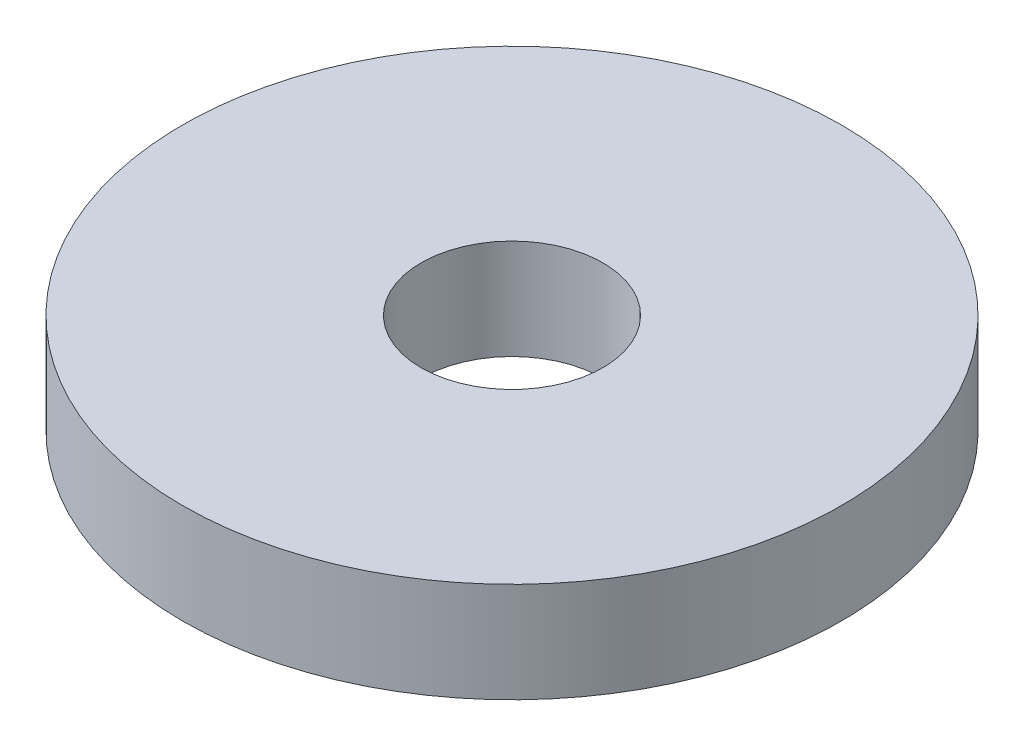
ISO-10303-21;
HEADER;
FILE_DESCRIPTION(('STEP AP214'),'2;1');
FILE_NAME('part.step','',(''),(''),'','','');
FILE_SCHEMA(('AUTOMOTIVE_DESIGN { 1 0 10303 214 1 1 1 1 }'));
ENDSEC;
DATA;
#1=APPLICATION_CONTEXT('core data for automotive mechanical design processes');
#2=APPLICATION_PROTOCOL_DEFINITION('international standard','automotive_design',2000,#1);
#3=PRODUCT_CONTEXT('',#1,'mechanical');
#4=PRODUCT('Part','Part','',(#3));
#5=PRODUCT_RELATED_PRODUCT_CATEGORY('part','',(#4));
#6=PRODUCT_DEFINITION_FORMATION('','',#4);
#7=PRODUCT_DEFINITION_CONTEXT('part definition',#1,'design');
#8=PRODUCT_DEFINITION('design','',#6,#7);
#9=PRODUCT_DEFINITION_SHAPE('','',#8);
#10=(LENGTH_UNIT() NAMED_UNIT(*) SI_UNIT(.MILLI.,.METRE.));
#11=(NAMED_UNIT(*) PLANE_ANGLE_UNIT() SI_UNIT($,.RADIAN.));
#12=(NAMED_UNIT(*) SI_UNIT($,.STERADIAN.) SOLID_ANGLE_UNIT());
#13=UNCERTAINTY_MEASURE_WITH_UNIT(LENGTH_MEASURE(1.E-05),#10,'distance_accuracy_value','');
#14=(GEOMETRIC_REPRESENTATION_CONTEXT(3) GLOBAL_UNCERTAINTY_ASSIGNED_CONTEXT((#13)) GLOBAL_UNIT_ASSIGNED_CONTEXT((#10,
#11,#12)) REPRESENTATION_CONTEXT('',''));
#15=CARTESIAN_POINT('',(0.,0.,0.));
#16=DIRECTION('',(0.,0.,1.));
#17=DIRECTION('',(1.,0.,0.));
#18=AXIS2_PLACEMENT_3D('',#15,#16,#17);
#19=CARTESIAN_POINT('',(0.,22.,0.));
#20=DIRECTION('',(0.,-1.,0.));
#21=DIRECTION('',(0.,0.,-1.));
#22=AXIS2_PLACEMENT_3D('',#19,#20,#21);
#23=CYLINDRICAL_SURFACE('',#22,72.5);
#24=CARTESIAN_POINT('',(0.,22.,0.));
#25=DIRECTION('',(0.,1.,0.));
#26=DIRECTION('',(0.,0.,1.));
#27=AXIS2_PLACEMENT_3D('',#24,#25,#26);
#28=CIRCLE('',#27,72.5);
#29=CARTESIAN_POINT('',(0.,22.,72.5));
#30=VERTEX_POINT('',#29);
#31=EDGE_CURVE('E10',#30,#30,#28,.T.);
#32=ORIENTED_EDGE('',*,*,#31,.F.);
#33=EDGE_LOOP('',(#32));
#34=FACE_BOUND('',#33,.T.);
#35=CARTESIAN_POINT('',(0.,0.,0.));
#36=DIRECTION('',(0.,1.,0.));
#37=DIRECTION('',(0.,0.,1.));
#38=AXIS2_PLACEMENT_3D('',#35,#36,#37);
#39=CIRCLE('',#38,72.5);
#40=CARTESIAN_POINT('',(0.,0.,72.5));
#41=VERTEX_POINT('',#40);
#42=EDGE_CURVE('E37',#41,#41,#39,.T.);
#43=ORIENTED_EDGE('',*,*,#42,.T.);
#44=EDGE_LOOP('',(#43));
#45=FACE_BOUND('',#44,.T.);
#46=ADVANCED_FACE('F40',(#34,#45),#23,.T.);
#47=CARTESIAN_POINT('',(0.,22.,0.));
#48=DIRECTION('',(0.,1.,0.));
#49=DIRECTION('',(0.,0.,1.));
#50=AXIS2_PLACEMENT_3D('',#47,#48,#49);
#51=PLANE('',#50);
#52=CARTESIAN_POINT('',(0.,22.,0.));
#53=DIRECTION('',(0.,1.,0.));
#54=DIRECTION('',(0.,0.,1.));
#55=AXIS2_PLACEMENT_3D('',#52,#53,#54);
#56=CIRCLE('',#55,20.);
#57=CARTESIAN_POINT('',(0.,22.,20.));
#58=VERTEX_POINT('',#57);
#59=EDGE_CURVE('E50',#58,#58,#56,.T.);
#60=ORIENTED_EDGE('',*,*,#59,.F.);
#61=EDGE_LOOP('',(#60));
#62=FACE_BOUND('',#61,.T.);
#63=ORIENTED_EDGE('',*,*,#31,.T.);
#64=EDGE_LOOP('',(#63));
#65=FACE_BOUND('',#64,.T.);
#66=ADVANCED_FACE('F59',(#62,#65),#51,.T.);
#67=CARTESIAN_POINT('',(0.,0.,0.));
#68=DIRECTION('',(0.,1.,0.));
#69=DIRECTION('',(0.,0.,1.));
#70=AXIS2_PLACEMENT_3D('',#67,#68,#69);
#71=PLANE('',#70);
#72=CARTESIAN_POINT('',(0.,0.,0.));
#73=DIRECTION('',(0.,1.,0.));
#74=DIRECTION('',(0.,0.,1.));
#75=AXIS2_PLACEMENT_3D('',#72,#73,#74);
#76=CIRCLE('',#75,20.);
#77=CARTESIAN_POINT('',(0.,0.,20.));
#78=VERTEX_POINT('',#77);
#79=EDGE_CURVE('E47',#78,#78,#76,.T.);
#80=ORIENTED_EDGE('',*,*,#79,.T.);
#81=EDGE_LOOP('',(#80));
#82=FACE_BOUND('',#81,.T.);
#83=ORIENTED_EDGE('',*,*,#42,.F.);
#84=EDGE_LOOP('',(#83));
#85=FACE_BOUND('',#84,.T.);
#86=ADVANCED_FACE('F58',(#82,#85),#71,.F.);
#87=CARTESIAN_POINT('',(0.,22.,0.));
#88=DIRECTION('',(0.,-1.,0.));
#89=DIRECTION('',(0.,0.,-1.));
#90=AXIS2_PLACEMENT_3D('',#87,#88,#89);
#91=CYLINDRICAL_SURFACE('',#90,20.);
#92=ORIENTED_EDGE('',*,*,#59,.T.);
#93=EDGE_LOOP('',(#92));
#94=FACE_BOUND('',#93,.T.);
#95=ORIENTED_EDGE('',*,*,#79,.F.);
#96=EDGE_LOOP('',(#95));
#97=FACE_BOUND('',#96,.T.);
#98=ADVANCED_FACE('F54',(#94,#97),#91,.F.);
#99=CLOSED_SHELL('',(#46,#66,#86,#98));
#100=MANIFOLD_SOLID_BREP('B2',#99);
#101=ADVANCED_BREP_SHAPE_REPRESENTATION('',(#18,#100),#14);
#102=SHAPE_DEFINITION_REPRESENTATION(#9,#101);
ENDSEC;
END-ISO-10303-21;
